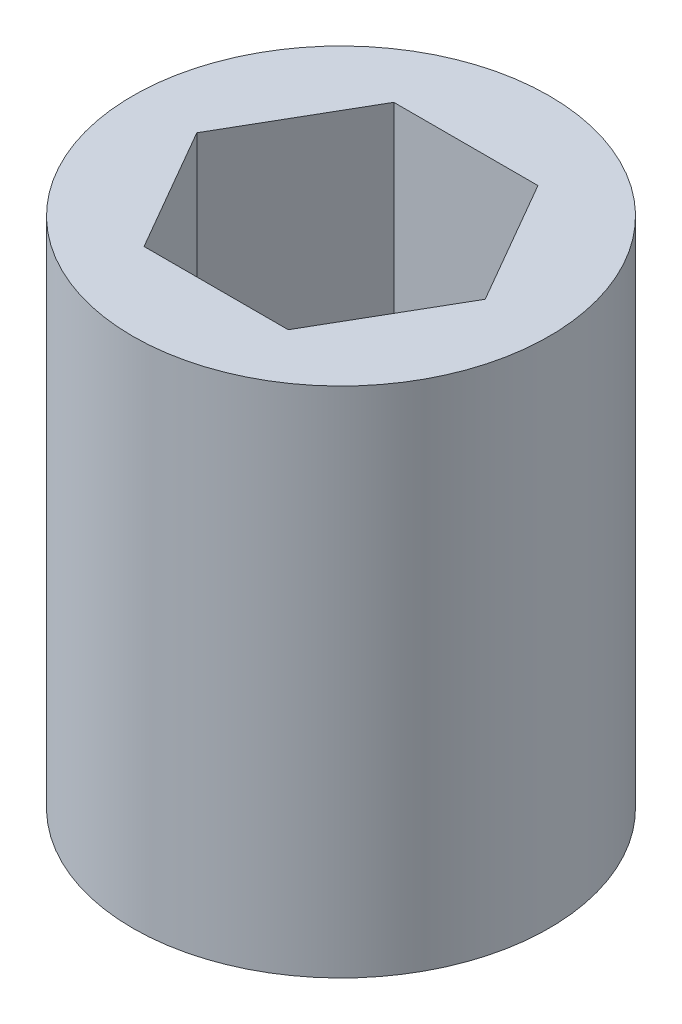
ISO-10303-21;
HEADER;
FILE_DESCRIPTION(('STEP AP214'),'2;1');
FILE_NAME('part.step','',(''),(''),'','','');
FILE_SCHEMA(('AUTOMOTIVE_DESIGN { 1 0 10303 214 1 1 1 1 }'));
ENDSEC;
DATA;
#1=APPLICATION_CONTEXT('core data for automotive mechanical design processes');
#2=APPLICATION_PROTOCOL_DEFINITION('international standard','automotive_design',2000,#1);
#3=PRODUCT_CONTEXT('',#1,'mechanical');
#4=PRODUCT('Part','Part','',(#3));
#5=PRODUCT_RELATED_PRODUCT_CATEGORY('part','',(#4));
#6=PRODUCT_DEFINITION_FORMATION('','',#4);
#7=PRODUCT_DEFINITION_CONTEXT('part definition',#1,'design');
#8=PRODUCT_DEFINITION('design','',#6,#7);
#9=PRODUCT_DEFINITION_SHAPE('','',#8);
#10=(LENGTH_UNIT() NAMED_UNIT(*) SI_UNIT(.MILLI.,.METRE.));
#11=(NAMED_UNIT(*) PLANE_ANGLE_UNIT() SI_UNIT($,.RADIAN.));
#12=(NAMED_UNIT(*) SI_UNIT($,.STERADIAN.) SOLID_ANGLE_UNIT());
#13=UNCERTAINTY_MEASURE_WITH_UNIT(LENGTH_MEASURE(1.E-05),#10,'distance_accuracy_value','');
#14=(GEOMETRIC_REPRESENTATION_CONTEXT(3) GLOBAL_UNCERTAINTY_ASSIGNED_CONTEXT((#13)) GLOBAL_UNIT_ASSIGNED_CONTEXT((#10,
#11,#12)) REPRESENTATION_CONTEXT('',''));
#15=CARTESIAN_POINT('',(0.,0.,0.));
#16=DIRECTION('',(0.,0.,1.));
#17=DIRECTION('',(1.,0.,0.));
#18=AXIS2_PLACEMENT_3D('',#15,#16,#17);
#19=CARTESIAN_POINT('',(0.,4.,0.));
#20=DIRECTION('',(0.,-1.,0.));
#21=DIRECTION('',(0.,0.,-1.));
#22=AXIS2_PLACEMENT_3D('',#19,#20,#21);
#23=CYLINDRICAL_SURFACE('',#22,1.625);
#24=CARTESIAN_POINT('',(0.,4.,0.));
#25=DIRECTION('',(0.,1.,0.));
#26=DIRECTION('',(0.,0.,1.));
#27=AXIS2_PLACEMENT_3D('',#24,#25,#26);
#28=CIRCLE('',#27,1.625);
#29=CARTESIAN_POINT('',(0.,4.,1.625));
#30=VERTEX_POINT('',#29);
#31=EDGE_CURVE('E11',#30,#30,#28,.T.);
#32=ORIENTED_EDGE('',*,*,#31,.F.);
#33=EDGE_LOOP('',(#32));
#34=FACE_BOUND('',#33,.T.);
#35=CARTESIAN_POINT('',(0.,0.,0.));
#36=DIRECTION('',(0.,1.,0.));
#37=DIRECTION('',(0.,0.,1.));
#38=AXIS2_PLACEMENT_3D('',#35,#36,#37);
#39=CIRCLE('',#38,1.625);
#40=CARTESIAN_POINT('',(0.,0.,1.625));
#41=VERTEX_POINT('',#40);
#42=EDGE_CURVE('E42',#41,#41,#39,.T.);
#43=ORIENTED_EDGE('',*,*,#42,.T.);
#44=EDGE_LOOP('',(#43));
#45=FACE_BOUND('',#44,.T.);
#46=ADVANCED_FACE('F39',(#34,#45),#23,.T.);
#47=CARTESIAN_POINT('',(0.,4.,0.));
#48=DIRECTION('',(0.,1.,0.));
#49=DIRECTION('',(0.,0.,1.));
#50=AXIS2_PLACEMENT_3D('',#47,#48,#49);
#51=PLANE('',#50);
#52=DIRECTION('',(0.5,0.,-0.866025403784439));
#53=VECTOR('',#52,1.);
#54=CARTESIAN_POINT('',(0.5625,4.,0.974278579257495));
#55=LINE('',#54,#53);
#56=CARTESIAN_POINT('',(0.5625,4.,0.974278579257495));
#57=VERTEX_POINT('',#56);
#58=CARTESIAN_POINT('',(1.125,4.,0.));
#59=VERTEX_POINT('',#58);
#60=EDGE_CURVE('E54',#57,#59,#55,.T.);
#61=ORIENTED_EDGE('',*,*,#60,.F.);
#62=DIRECTION('',(1.,0.,0.));
#63=VECTOR('',#62,1.);
#64=CARTESIAN_POINT('',(-0.562500000000001,4.,0.974278579257494));
#65=LINE('',#64,#63);
#66=CARTESIAN_POINT('',(-0.562500000000001,4.,0.974278579257494));
#67=VERTEX_POINT('',#66);
#68=EDGE_CURVE('E147',#67,#57,#65,.T.);
#69=ORIENTED_EDGE('',*,*,#68,.F.);
#70=DIRECTION('',(0.5,0.,0.866025403784439));
#71=VECTOR('',#70,1.);
#72=CARTESIAN_POINT('',(-1.125,4.,0.));
#73=LINE('',#72,#71);
#74=CARTESIAN_POINT('',(-1.125,4.,0.));
#75=VERTEX_POINT('',#74);
#76=EDGE_CURVE('E144',#75,#67,#73,.T.);
#77=ORIENTED_EDGE('',*,*,#76,.F.);
#78=DIRECTION('',(-0.5,0.,0.866025403784439));
#79=VECTOR('',#78,1.);
#80=CARTESIAN_POINT('',(-0.5625,4.,-0.974278579257495));
#81=LINE('',#80,#79);
#82=CARTESIAN_POINT('',(-0.5625,4.,-0.974278579257495));
#83=VERTEX_POINT('',#82);
#84=EDGE_CURVE('E102',#83,#75,#81,.T.);
#85=ORIENTED_EDGE('',*,*,#84,.F.);
#86=DIRECTION('',(-1.,0.,0.));
#87=VECTOR('',#86,1.);
#88=CARTESIAN_POINT('',(0.5625,4.,-0.974278579257495));
#89=LINE('',#88,#87);
#90=CARTESIAN_POINT('',(0.5625,4.,-0.974278579257495));
#91=VERTEX_POINT('',#90);
#92=EDGE_CURVE('E138',#91,#83,#89,.T.);
#93=ORIENTED_EDGE('',*,*,#92,.F.);
#94=DIRECTION('',(-0.5,0.,-0.866025403784439));
#95=VECTOR('',#94,1.);
#96=CARTESIAN_POINT('',(1.125,4.,0.));
#97=LINE('',#96,#95);
#98=EDGE_CURVE('E134',#59,#91,#97,.T.);
#99=ORIENTED_EDGE('',*,*,#98,.F.);
#100=EDGE_LOOP('',(#61,#69,#77,#85,#93,#99));
#101=FACE_BOUND('',#100,.T.);
#102=ORIENTED_EDGE('',*,*,#31,.T.);
#103=EDGE_LOOP('',(#102));
#104=FACE_BOUND('',#103,.T.);
#105=ADVANCED_FACE('F166',(#101,#104),#51,.T.);
#106=CARTESIAN_POINT('',(0.,0.,0.));
#107=DIRECTION('',(0.,1.,0.));
#108=DIRECTION('',(0.,0.,1.));
#109=AXIS2_PLACEMENT_3D('',#106,#107,#108);
#110=PLANE('',#109);
#111=ORIENTED_EDGE('',*,*,#42,.F.);
#112=EDGE_LOOP('',(#111));
#113=FACE_BOUND('',#112,.T.);
#114=ADVANCED_FACE('F177',(#113),#110,.F.);
#115=CARTESIAN_POINT('',(0.5625,0.5,0.974278579257495));
#116=DIRECTION('',(0.866025403784439,0.,0.5));
#117=DIRECTION('',(0.5,0.,-0.866025403784439));
#118=AXIS2_PLACEMENT_3D('',#115,#116,#117);
#119=PLANE('',#118);
#120=ORIENTED_EDGE('',*,*,#60,.T.);
#121=DIRECTION('',(0.,1.,0.));
#122=VECTOR('',#121,1.);
#123=CARTESIAN_POINT('',(1.125,0.5,0.));
#124=LINE('',#123,#122);
#125=CARTESIAN_POINT('',(1.125,0.5,0.));
#126=VERTEX_POINT('',#125);
#127=EDGE_CURVE('E84',#126,#59,#124,.T.);
#128=ORIENTED_EDGE('',*,*,#127,.F.);
#129=DIRECTION('',(0.5,0.,-0.866025403784439));
#130=VECTOR('',#129,1.);
#131=CARTESIAN_POINT('',(0.5625,0.5,0.974278579257495));
#132=LINE('',#131,#130);
#133=CARTESIAN_POINT('',(0.5625,0.5,0.974278579257495));
#134=VERTEX_POINT('',#133);
#135=EDGE_CURVE('E150',#134,#126,#132,.T.);
#136=ORIENTED_EDGE('',*,*,#135,.F.);
#137=DIRECTION('',(0.,1.,0.));
#138=VECTOR('',#137,1.);
#139=CARTESIAN_POINT('',(0.5625,0.5,0.974278579257495));
#140=LINE('',#139,#138);
#141=EDGE_CURVE('E62',#134,#57,#140,.T.);
#142=ORIENTED_EDGE('',*,*,#141,.T.);
#143=EDGE_LOOP('',(#120,#128,#136,#142));
#144=FACE_BOUND('',#143,.T.);
#145=ADVANCED_FACE('F174',(#144),#119,.F.);
#146=CARTESIAN_POINT('',(-0.562500000000001,0.5,0.974278579257494));
#147=DIRECTION('',(0.,0.,1.));
#148=DIRECTION('',(1.,0.,0.));
#149=AXIS2_PLACEMENT_3D('',#146,#147,#148);
#150=PLANE('',#149);
#151=ORIENTED_EDGE('',*,*,#68,.T.);
#152=ORIENTED_EDGE('',*,*,#141,.F.);
#153=DIRECTION('',(1.,0.,0.));
#154=VECTOR('',#153,1.);
#155=CARTESIAN_POINT('',(-0.562500000000001,0.5,0.974278579257494));
#156=LINE('',#155,#154);
#157=CARTESIAN_POINT('',(-0.562500000000001,0.5,0.974278579257494));
#158=VERTEX_POINT('',#157);
#159=EDGE_CURVE('E116',#158,#134,#156,.T.);
#160=ORIENTED_EDGE('',*,*,#159,.F.);
#161=DIRECTION('',(0.,1.,0.));
#162=VECTOR('',#161,1.);
#163=CARTESIAN_POINT('',(-0.562500000000001,0.5,0.974278579257494));
#164=LINE('',#163,#162);
#165=EDGE_CURVE('E107',#158,#67,#164,.T.);
#166=ORIENTED_EDGE('',*,*,#165,.T.);
#167=EDGE_LOOP('',(#151,#152,#160,#166));
#168=FACE_BOUND('',#167,.T.);
#169=ADVANCED_FACE('F176',(#168),#150,.F.);
#170=CARTESIAN_POINT('',(-1.125,0.5,0.));
#171=DIRECTION('',(-0.866025403784439,0.,0.5));
#172=DIRECTION('',(0.5,0.,0.866025403784439));
#173=AXIS2_PLACEMENT_3D('',#170,#171,#172);
#174=PLANE('',#173);
#175=ORIENTED_EDGE('',*,*,#76,.T.);
#176=ORIENTED_EDGE('',*,*,#165,.F.);
#177=DIRECTION('',(0.5,0.,0.866025403784439));
#178=VECTOR('',#177,1.);
#179=CARTESIAN_POINT('',(-1.125,0.5,0.));
#180=LINE('',#179,#178);
#181=CARTESIAN_POINT('',(-1.125,0.5,0.));
#182=VERTEX_POINT('',#181);
#183=EDGE_CURVE('E111',#182,#158,#180,.T.);
#184=ORIENTED_EDGE('',*,*,#183,.F.);
#185=DIRECTION('',(0.,1.,0.));
#186=VECTOR('',#185,1.);
#187=CARTESIAN_POINT('',(-1.125,0.5,0.));
#188=LINE('',#187,#186);
#189=EDGE_CURVE('E95',#182,#75,#188,.T.);
#190=ORIENTED_EDGE('',*,*,#189,.T.);
#191=EDGE_LOOP('',(#175,#176,#184,#190));
#192=FACE_BOUND('',#191,.T.);
#193=ADVANCED_FACE('F112',(#192),#174,.F.);
#194=CARTESIAN_POINT('',(-0.5625,0.5,-0.974278579257495));
#195=DIRECTION('',(-0.866025403784439,0.,-0.5));
#196=DIRECTION('',(-0.5,0.,0.866025403784439));
#197=AXIS2_PLACEMENT_3D('',#194,#195,#196);
#198=PLANE('',#197);
#199=ORIENTED_EDGE('',*,*,#84,.T.);
#200=ORIENTED_EDGE('',*,*,#189,.F.);
#201=DIRECTION('',(-0.5,0.,0.866025403784439));
#202=VECTOR('',#201,1.);
#203=CARTESIAN_POINT('',(-0.5625,0.5,-0.974278579257495));
#204=LINE('',#203,#202);
#205=CARTESIAN_POINT('',(-0.5625,0.5,-0.974278579257495));
#206=VERTEX_POINT('',#205);
#207=EDGE_CURVE('E99',#206,#182,#204,.T.);
#208=ORIENTED_EDGE('',*,*,#207,.F.);
#209=DIRECTION('',(0.,1.,0.));
#210=VECTOR('',#209,1.);
#211=CARTESIAN_POINT('',(-0.5625,0.5,-0.974278579257495));
#212=LINE('',#211,#210);
#213=EDGE_CURVE('E108',#206,#83,#212,.T.);
#214=ORIENTED_EDGE('',*,*,#213,.T.);
#215=EDGE_LOOP('',(#199,#200,#208,#214));
#216=FACE_BOUND('',#215,.T.);
#217=ADVANCED_FACE('F97',(#216),#198,.F.);
#218=CARTESIAN_POINT('',(0.5625,0.5,-0.974278579257495));
#219=DIRECTION('',(0.,0.,-1.));
#220=DIRECTION('',(-1.,0.,0.));
#221=AXIS2_PLACEMENT_3D('',#218,#219,#220);
#222=PLANE('',#221);
#223=ORIENTED_EDGE('',*,*,#92,.T.);
#224=ORIENTED_EDGE('',*,*,#213,.F.);
#225=DIRECTION('',(-1.,0.,0.));
#226=VECTOR('',#225,1.);
#227=CARTESIAN_POINT('',(0.5625,0.5,-0.974278579257495));
#228=LINE('',#227,#226);
#229=CARTESIAN_POINT('',(0.5625,0.5,-0.974278579257495));
#230=VERTEX_POINT('',#229);
#231=EDGE_CURVE('E122',#230,#206,#228,.T.);
#232=ORIENTED_EDGE('',*,*,#231,.F.);
#233=DIRECTION('',(0.,1.,0.));
#234=VECTOR('',#233,1.);
#235=CARTESIAN_POINT('',(0.5625,0.5,-0.974278579257495));
#236=LINE('',#235,#234);
#237=EDGE_CURVE('E157',#230,#91,#236,.T.);
#238=ORIENTED_EDGE('',*,*,#237,.T.);
#239=EDGE_LOOP('',(#223,#224,#232,#238));
#240=FACE_BOUND('',#239,.T.);
#241=ADVANCED_FACE('F170',(#240),#222,.F.);
#242=CARTESIAN_POINT('',(1.125,0.5,0.));
#243=DIRECTION('',(0.866025403784439,0.,-0.5));
#244=DIRECTION('',(-0.5,0.,-0.866025403784439));
#245=AXIS2_PLACEMENT_3D('',#242,#243,#244);
#246=PLANE('',#245);
#247=ORIENTED_EDGE('',*,*,#98,.T.);
#248=ORIENTED_EDGE('',*,*,#237,.F.);
#249=DIRECTION('',(-0.5,0.,-0.866025403784439));
#250=VECTOR('',#249,1.);
#251=CARTESIAN_POINT('',(1.125,0.5,0.));
#252=LINE('',#251,#250);
#253=EDGE_CURVE('E126',#126,#230,#252,.T.);
#254=ORIENTED_EDGE('',*,*,#253,.F.);
#255=ORIENTED_EDGE('',*,*,#127,.T.);
#256=EDGE_LOOP('',(#247,#248,#254,#255));
#257=FACE_BOUND('',#256,.T.);
#258=ADVANCED_FACE('F163',(#257),#246,.F.);
#259=CARTESIAN_POINT('',(0.,0.5,0.));
#260=DIRECTION('',(0.,1.,0.));
#261=DIRECTION('',(0.,0.,1.));
#262=AXIS2_PLACEMENT_3D('',#259,#260,#261);
#263=PLANE('',#262);
#264=ORIENTED_EDGE('',*,*,#135,.T.);
#265=ORIENTED_EDGE('',*,*,#253,.T.);
#266=ORIENTED_EDGE('',*,*,#231,.T.);
#267=ORIENTED_EDGE('',*,*,#207,.T.);
#268=ORIENTED_EDGE('',*,*,#183,.T.);
#269=ORIENTED_EDGE('',*,*,#159,.T.);
#270=EDGE_LOOP('',(#264,#265,#266,#267,#268,#269));
#271=FACE_BOUND('',#270,.T.);
#272=ADVANCED_FACE('F119',(#271),#263,.T.);
#273=CLOSED_SHELL('',(#46,#105,#114,#145,#169,#193,#217,#241,#258,#272));
#274=MANIFOLD_SOLID_BREP('B2',#273);
#275=ADVANCED_BREP_SHAPE_REPRESENTATION('',(#18,#274),#14);
#276=SHAPE_DEFINITION_REPRESENTATION(#9,#275);
ENDSEC;
END-ISO-10303-21;
